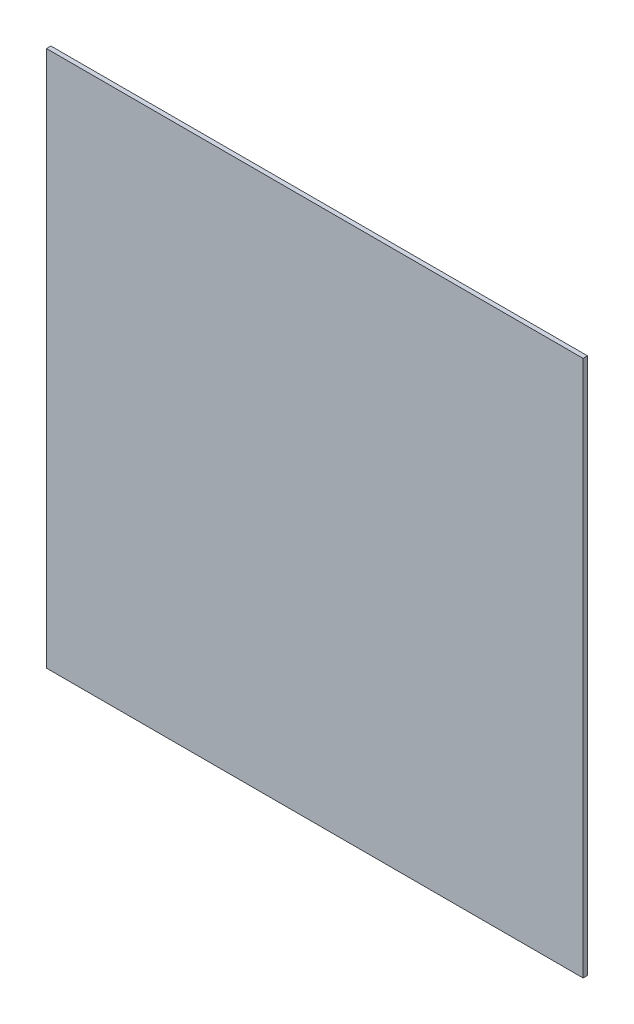
ISO-10303-21;
HEADER;
FILE_DESCRIPTION(('STEP AP214'),'2;1');
FILE_NAME('part.step','',(''),(''),'','','');
FILE_SCHEMA(('AUTOMOTIVE_DESIGN { 1 0 10303 214 1 1 1 1 }'));
ENDSEC;
DATA;
#1=APPLICATION_CONTEXT('core data for automotive mechanical design processes');
#2=APPLICATION_PROTOCOL_DEFINITION('international standard','automotive_design',2000,#1);
#3=PRODUCT_CONTEXT('',#1,'mechanical');
#4=PRODUCT('Part','Part','',(#3));
#5=PRODUCT_RELATED_PRODUCT_CATEGORY('part','',(#4));
#6=PRODUCT_DEFINITION_FORMATION('','',#4);
#7=PRODUCT_DEFINITION_CONTEXT('part definition',#1,'design');
#8=PRODUCT_DEFINITION('design','',#6,#7);
#9=PRODUCT_DEFINITION_SHAPE('','',#8);
#10=(LENGTH_UNIT() NAMED_UNIT(*) SI_UNIT(.MILLI.,.METRE.));
#11=(NAMED_UNIT(*) PLANE_ANGLE_UNIT() SI_UNIT($,.RADIAN.));
#12=(NAMED_UNIT(*) SI_UNIT($,.STERADIAN.) SOLID_ANGLE_UNIT());
#13=UNCERTAINTY_MEASURE_WITH_UNIT(LENGTH_MEASURE(1.E-05),#10,'distance_accuracy_value','');
#14=(GEOMETRIC_REPRESENTATION_CONTEXT(3) GLOBAL_UNCERTAINTY_ASSIGNED_CONTEXT((#13)) GLOBAL_UNIT_ASSIGNED_CONTEXT((#10,
#11,#12)) REPRESENTATION_CONTEXT('',''));
#15=CARTESIAN_POINT('',(0.,0.,0.));
#16=DIRECTION('',(0.,0.,1.));
#17=DIRECTION('',(1.,0.,0.));
#18=AXIS2_PLACEMENT_3D('',#15,#16,#17);
#19=CARTESIAN_POINT('',(-3.1,-3.1,0.));
#20=DIRECTION('',(0.,-1.,0.));
#21=DIRECTION('',(0.,0.,1.));
#22=AXIS2_PLACEMENT_3D('',#19,#20,#21);
#23=PLANE('',#22);
#24=DIRECTION('',(-1.,0.,0.));
#25=VECTOR('',#24,1.);
#26=CARTESIAN_POINT('',(3.1,-3.1,0.));
#27=LINE('',#26,#25);
#28=CARTESIAN_POINT('',(3.1,-3.1,0.));
#29=VERTEX_POINT('',#28);
#30=CARTESIAN_POINT('',(-3.1,-3.1,0.));
#31=VERTEX_POINT('',#30);
#32=EDGE_CURVE('E11',#29,#31,#27,.T.);
#33=ORIENTED_EDGE('',*,*,#32,.F.);
#34=DIRECTION('',(0.,0.,-1.));
#35=VECTOR('',#34,1.);
#36=CARTESIAN_POINT('',(3.1,-3.1,0.051));
#37=LINE('',#36,#35);
#38=CARTESIAN_POINT('',(3.1,-3.1,0.051));
#39=VERTEX_POINT('',#38);
#40=EDGE_CURVE('E24',#39,#29,#37,.T.);
#41=ORIENTED_EDGE('',*,*,#40,.F.);
#42=DIRECTION('',(1.,0.,0.));
#43=VECTOR('',#42,1.);
#44=CARTESIAN_POINT('',(-3.1,-3.1,0.051));
#45=LINE('',#44,#43);
#46=CARTESIAN_POINT('',(-3.1,-3.1,0.051));
#47=VERTEX_POINT('',#46);
#48=EDGE_CURVE('E88',#47,#39,#45,.T.);
#49=ORIENTED_EDGE('',*,*,#48,.F.);
#50=DIRECTION('',(0.,0.,1.));
#51=VECTOR('',#50,1.);
#52=CARTESIAN_POINT('',(-3.1,-3.1,0.));
#53=LINE('',#52,#51);
#54=EDGE_CURVE('E77',#31,#47,#53,.T.);
#55=ORIENTED_EDGE('',*,*,#54,.F.);
#56=EDGE_LOOP('',(#33,#41,#49,#55));
#57=FACE_BOUND('',#56,.T.);
#58=ADVANCED_FACE('F17',(#57),#23,.T.);
#59=CARTESIAN_POINT('',(3.1,-3.1,0.));
#60=DIRECTION('',(1.,0.,0.));
#61=DIRECTION('',(0.,0.,1.));
#62=AXIS2_PLACEMENT_3D('',#59,#60,#61);
#63=PLANE('',#62);
#64=DIRECTION('',(0.,-1.,0.));
#65=VECTOR('',#64,1.);
#66=CARTESIAN_POINT('',(3.1,3.1,0.));
#67=LINE('',#66,#65);
#68=CARTESIAN_POINT('',(3.1,3.1,0.));
#69=VERTEX_POINT('',#68);
#70=EDGE_CURVE('E85',#69,#29,#67,.T.);
#71=ORIENTED_EDGE('',*,*,#70,.F.);
#72=DIRECTION('',(0.,0.,-1.));
#73=VECTOR('',#72,1.);
#74=CARTESIAN_POINT('',(3.1,3.1,0.051));
#75=LINE('',#74,#73);
#76=CARTESIAN_POINT('',(3.1,3.1,0.051));
#77=VERTEX_POINT('',#76);
#78=EDGE_CURVE('E83',#77,#69,#75,.T.);
#79=ORIENTED_EDGE('',*,*,#78,.F.);
#80=DIRECTION('',(0.,1.,0.));
#81=VECTOR('',#80,1.);
#82=CARTESIAN_POINT('',(3.1,-3.1,0.051));
#83=LINE('',#82,#81);
#84=EDGE_CURVE('E72',#39,#77,#83,.T.);
#85=ORIENTED_EDGE('',*,*,#84,.F.);
#86=ORIENTED_EDGE('',*,*,#40,.T.);
#87=EDGE_LOOP('',(#71,#79,#85,#86));
#88=FACE_BOUND('',#87,.T.);
#89=ADVANCED_FACE('F90',(#88),#63,.T.);
#90=CARTESIAN_POINT('',(3.1,3.1,0.));
#91=DIRECTION('',(0.,1.,0.));
#92=DIRECTION('',(0.,0.,1.));
#93=AXIS2_PLACEMENT_3D('',#90,#91,#92);
#94=PLANE('',#93);
#95=DIRECTION('',(1.,0.,0.));
#96=VECTOR('',#95,1.);
#97=CARTESIAN_POINT('',(-3.1,3.1,0.));
#98=LINE('',#97,#96);
#99=CARTESIAN_POINT('',(-3.1,3.1,0.));
#100=VERTEX_POINT('',#99);
#101=EDGE_CURVE('E60',#100,#69,#98,.T.);
#102=ORIENTED_EDGE('',*,*,#101,.F.);
#103=DIRECTION('',(0.,0.,-1.));
#104=VECTOR('',#103,1.);
#105=CARTESIAN_POINT('',(-3.1,3.1,0.051));
#106=LINE('',#105,#104);
#107=CARTESIAN_POINT('',(-3.1,3.1,0.051));
#108=VERTEX_POINT('',#107);
#109=EDGE_CURVE('E54',#108,#100,#106,.T.);
#110=ORIENTED_EDGE('',*,*,#109,.F.);
#111=DIRECTION('',(-1.,0.,0.));
#112=VECTOR('',#111,1.);
#113=CARTESIAN_POINT('',(3.1,3.1,0.051));
#114=LINE('',#113,#112);
#115=EDGE_CURVE('E58',#77,#108,#114,.T.);
#116=ORIENTED_EDGE('',*,*,#115,.F.);
#117=ORIENTED_EDGE('',*,*,#78,.T.);
#118=EDGE_LOOP('',(#102,#110,#116,#117));
#119=FACE_BOUND('',#118,.T.);
#120=ADVANCED_FACE('F56',(#119),#94,.T.);
#121=CARTESIAN_POINT('',(-3.1,3.1,0.));
#122=DIRECTION('',(-1.,0.,0.));
#123=DIRECTION('',(0.,0.,1.));
#124=AXIS2_PLACEMENT_3D('',#121,#122,#123);
#125=PLANE('',#124);
#126=DIRECTION('',(0.,1.,0.));
#127=VECTOR('',#126,1.);
#128=CARTESIAN_POINT('',(-3.1,-3.1,0.));
#129=LINE('',#128,#127);
#130=EDGE_CURVE('E73',#31,#100,#129,.T.);
#131=ORIENTED_EDGE('',*,*,#130,.F.);
#132=ORIENTED_EDGE('',*,*,#54,.T.);
#133=DIRECTION('',(0.,-1.,0.));
#134=VECTOR('',#133,1.);
#135=CARTESIAN_POINT('',(-3.1,3.1,0.051));
#136=LINE('',#135,#134);
#137=EDGE_CURVE('E70',#108,#47,#136,.T.);
#138=ORIENTED_EDGE('',*,*,#137,.F.);
#139=ORIENTED_EDGE('',*,*,#109,.T.);
#140=EDGE_LOOP('',(#131,#132,#138,#139));
#141=FACE_BOUND('',#140,.T.);
#142=ADVANCED_FACE('F76',(#141),#125,.T.);
#143=CARTESIAN_POINT('',(-3.1,3.1,0.));
#144=DIRECTION('',(0.,0.,-1.));
#145=DIRECTION('',(0.,1.,0.));
#146=AXIS2_PLACEMENT_3D('',#143,#144,#145);
#147=PLANE('',#146);
#148=ORIENTED_EDGE('',*,*,#101,.T.);
#149=ORIENTED_EDGE('',*,*,#70,.T.);
#150=ORIENTED_EDGE('',*,*,#32,.T.);
#151=ORIENTED_EDGE('',*,*,#130,.T.);
#152=EDGE_LOOP('',(#148,#149,#150,#151));
#153=FACE_BOUND('',#152,.T.);
#154=ADVANCED_FACE('F91',(#153),#147,.T.);
#155=CARTESIAN_POINT('',(-3.1,-3.1,0.051));
#156=DIRECTION('',(0.,0.,1.));
#157=DIRECTION('',(0.,1.,0.));
#158=AXIS2_PLACEMENT_3D('',#155,#156,#157);
#159=PLANE('',#158);
#160=ORIENTED_EDGE('',*,*,#48,.T.);
#161=ORIENTED_EDGE('',*,*,#84,.T.);
#162=ORIENTED_EDGE('',*,*,#115,.T.);
#163=ORIENTED_EDGE('',*,*,#137,.T.);
#164=EDGE_LOOP('',(#160,#161,#162,#163));
#165=FACE_BOUND('',#164,.T.);
#166=ADVANCED_FACE('F69',(#165),#159,.T.);
#167=CLOSED_SHELL('',(#58,#89,#120,#142,#154,#166));
#168=MANIFOLD_SOLID_BREP('B1',#167);
#169=ADVANCED_BREP_SHAPE_REPRESENTATION('',(#18,#168),#14);
#170=SHAPE_DEFINITION_REPRESENTATION(#9,#169);
ENDSEC;
END-ISO-10303-21;
